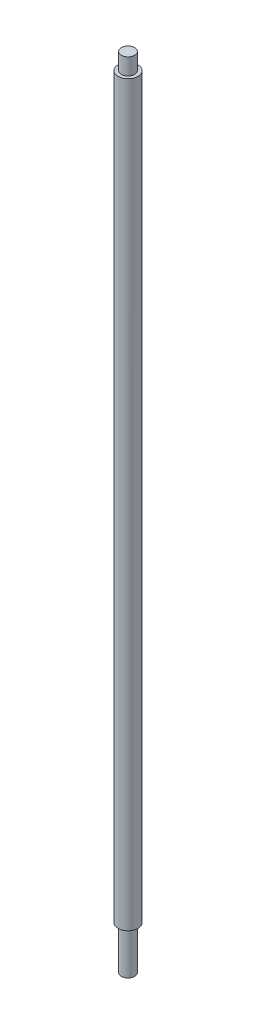
ISO-10303-21;
HEADER;
FILE_DESCRIPTION(('STEP AP214'),'2;1');
FILE_NAME('part.step','',(''),(''),'','','');
FILE_SCHEMA(('AUTOMOTIVE_DESIGN { 1 0 10303 214 1 1 1 1 }'));
ENDSEC;
DATA;
#1=APPLICATION_CONTEXT('core data for automotive mechanical design processes');
#2=APPLICATION_PROTOCOL_DEFINITION('international standard','automotive_design',2000,#1);
#3=PRODUCT_CONTEXT('',#1,'mechanical');
#4=PRODUCT('Part','Part','',(#3));
#5=PRODUCT_RELATED_PRODUCT_CATEGORY('part','',(#4));
#6=PRODUCT_DEFINITION_FORMATION('','',#4);
#7=PRODUCT_DEFINITION_CONTEXT('part definition',#1,'design');
#8=PRODUCT_DEFINITION('design','',#6,#7);
#9=PRODUCT_DEFINITION_SHAPE('','',#8);
#10=(LENGTH_UNIT() NAMED_UNIT(*) SI_UNIT(.MILLI.,.METRE.));
#11=(NAMED_UNIT(*) PLANE_ANGLE_UNIT() SI_UNIT($,.RADIAN.));
#12=(NAMED_UNIT(*) SI_UNIT($,.STERADIAN.) SOLID_ANGLE_UNIT());
#13=UNCERTAINTY_MEASURE_WITH_UNIT(LENGTH_MEASURE(1.E-05),#10,'distance_accuracy_value','');
#14=(GEOMETRIC_REPRESENTATION_CONTEXT(3) GLOBAL_UNCERTAINTY_ASSIGNED_CONTEXT((#13)) GLOBAL_UNIT_ASSIGNED_CONTEXT((#10,
#11,#12)) REPRESENTATION_CONTEXT('',''));
#15=CARTESIAN_POINT('',(0.,0.,0.));
#16=DIRECTION('',(0.,0.,1.));
#17=DIRECTION('',(1.,0.,0.));
#18=AXIS2_PLACEMENT_3D('',#15,#16,#17);
#19=CARTESIAN_POINT('',(0.,240.,0.));
#20=DIRECTION('',(0.,-1.,0.));
#21=DIRECTION('',(0.,0.,-1.));
#22=AXIS2_PLACEMENT_3D('',#19,#20,#21);
#23=CYLINDRICAL_SURFACE('',#22,6.);
#24=CARTESIAN_POINT('',(0.,230.,0.));
#25=DIRECTION('',(0.,1.,0.));
#26=DIRECTION('',(0.,0.,1.));
#27=AXIS2_PLACEMENT_3D('',#24,#25,#26);
#28=CIRCLE('',#27,6.);
#29=CARTESIAN_POINT('',(0.,230.,6.));
#30=VERTEX_POINT('',#29);
#31=EDGE_CURVE('E10',#30,#30,#28,.T.);
#32=ORIENTED_EDGE('',*,*,#31,.F.);
#33=EDGE_LOOP('',(#32));
#34=FACE_BOUND('',#33,.T.);
#35=CARTESIAN_POINT('',(0.,-214.000000122,0.));
#36=DIRECTION('',(0.,-1.,0.));
#37=DIRECTION('',(0.,0.,-1.));
#38=AXIS2_PLACEMENT_3D('',#35,#36,#37);
#39=CIRCLE('',#38,6.);
#40=CARTESIAN_POINT('',(0.,-214.000000122,-6.));
#41=VERTEX_POINT('',#40);
#42=EDGE_CURVE('E47',#41,#41,#39,.T.);
#43=ORIENTED_EDGE('',*,*,#42,.F.);
#44=EDGE_LOOP('',(#43));
#45=FACE_BOUND('',#44,.T.);
#46=ADVANCED_FACE('F32',(#34,#45),#23,.T.);
#47=CARTESIAN_POINT('',(0.,230.,0.));
#48=DIRECTION('',(0.,1.,0.));
#49=DIRECTION('',(0.,0.,1.));
#50=AXIS2_PLACEMENT_3D('',#47,#48,#49);
#51=PLANE('',#50);
#52=CARTESIAN_POINT('',(0.,230.,0.));
#53=DIRECTION('',(0.,1.,0.));
#54=DIRECTION('',(0.,0.,1.));
#55=AXIS2_PLACEMENT_3D('',#52,#53,#54);
#56=CIRCLE('',#55,4.);
#57=CARTESIAN_POINT('',(0.,230.,4.));
#58=VERTEX_POINT('',#57);
#59=EDGE_CURVE('E38',#58,#58,#56,.T.);
#60=ORIENTED_EDGE('',*,*,#59,.F.);
#61=EDGE_LOOP('',(#60));
#62=FACE_BOUND('',#61,.T.);
#63=ORIENTED_EDGE('',*,*,#31,.T.);
#64=EDGE_LOOP('',(#63));
#65=FACE_BOUND('',#64,.T.);
#66=ADVANCED_FACE('F69',(#62,#65),#51,.T.);
#67=CARTESIAN_POINT('',(0.,230.,0.));
#68=DIRECTION('',(0.,1.,0.));
#69=DIRECTION('',(0.,0.,1.));
#70=AXIS2_PLACEMENT_3D('',#67,#68,#69);
#71=CYLINDRICAL_SURFACE('',#70,4.);
#72=ORIENTED_EDGE('',*,*,#59,.T.);
#73=EDGE_LOOP('',(#72));
#74=FACE_BOUND('',#73,.T.);
#75=CARTESIAN_POINT('',(0.,240.,0.));
#76=DIRECTION('',(0.,1.,0.));
#77=DIRECTION('',(0.,0.,1.));
#78=AXIS2_PLACEMENT_3D('',#75,#76,#77);
#79=CIRCLE('',#78,4.);
#80=CARTESIAN_POINT('',(0.,240.,4.));
#81=VERTEX_POINT('',#80);
#82=EDGE_CURVE('E42',#81,#81,#79,.T.);
#83=ORIENTED_EDGE('',*,*,#82,.F.);
#84=EDGE_LOOP('',(#83));
#85=FACE_BOUND('',#84,.T.);
#86=ADVANCED_FACE('F74',(#74,#85),#71,.T.);
#87=CARTESIAN_POINT('',(0.,240.,0.));
#88=DIRECTION('',(0.,1.,0.));
#89=DIRECTION('',(0.,0.,1.));
#90=AXIS2_PLACEMENT_3D('',#87,#88,#89);
#91=PLANE('',#90);
#92=ORIENTED_EDGE('',*,*,#82,.T.);
#93=EDGE_LOOP('',(#92));
#94=FACE_BOUND('',#93,.T.);
#95=ADVANCED_FACE('F64',(#94),#91,.T.);
#96=CARTESIAN_POINT('',(0.,-214.000000122,0.));
#97=DIRECTION('',(0.,-1.,0.));
#98=DIRECTION('',(0.,0.,-1.));
#99=AXIS2_PLACEMENT_3D('',#96,#97,#98);
#100=PLANE('',#99);
#101=CARTESIAN_POINT('',(0.,-214.000000122,0.));
#102=DIRECTION('',(0.,-1.,0.));
#103=DIRECTION('',(0.,0.,-1.));
#104=AXIS2_PLACEMENT_3D('',#101,#102,#103);
#105=CIRCLE('',#104,4.);
#106=CARTESIAN_POINT('',(0.,-214.000000122,-4.));
#107=VERTEX_POINT('',#106);
#108=EDGE_CURVE('E51',#107,#107,#105,.T.);
#109=ORIENTED_EDGE('',*,*,#108,.F.);
#110=EDGE_LOOP('',(#109));
#111=FACE_BOUND('',#110,.T.);
#112=ORIENTED_EDGE('',*,*,#42,.T.);
#113=EDGE_LOOP('',(#112));
#114=FACE_BOUND('',#113,.T.);
#115=ADVANCED_FACE('F61',(#111,#114),#100,.T.);
#116=CARTESIAN_POINT('',(0.,-214.000000122,0.));
#117=DIRECTION('',(0.,-1.,0.));
#118=DIRECTION('',(0.,0.,-1.));
#119=AXIS2_PLACEMENT_3D('',#116,#117,#118);
#120=CYLINDRICAL_SURFACE('',#119,4.);
#121=ORIENTED_EDGE('',*,*,#108,.T.);
#122=EDGE_LOOP('',(#121));
#123=FACE_BOUND('',#122,.T.);
#124=CARTESIAN_POINT('',(0.,-240.,0.));
#125=DIRECTION('',(0.,-1.,0.));
#126=DIRECTION('',(0.,0.,-1.));
#127=AXIS2_PLACEMENT_3D('',#124,#125,#126);
#128=CIRCLE('',#127,4.);
#129=CARTESIAN_POINT('',(0.,-240.,-4.));
#130=VERTEX_POINT('',#129);
#131=EDGE_CURVE('E52',#130,#130,#128,.T.);
#132=ORIENTED_EDGE('',*,*,#131,.F.);
#133=EDGE_LOOP('',(#132));
#134=FACE_BOUND('',#133,.T.);
#135=ADVANCED_FACE('F58',(#123,#134),#120,.T.);
#136=CARTESIAN_POINT('',(0.,-240.,0.));
#137=DIRECTION('',(0.,1.,0.));
#138=DIRECTION('',(0.,0.,1.));
#139=AXIS2_PLACEMENT_3D('',#136,#137,#138);
#140=PLANE('',#139);
#141=ORIENTED_EDGE('',*,*,#131,.T.);
#142=EDGE_LOOP('',(#141));
#143=FACE_BOUND('',#142,.T.);
#144=ADVANCED_FACE('F84',(#143),#140,.F.);
#145=CLOSED_SHELL('',(#46,#66,#86,#95,#115,#135,#144));
#146=MANIFOLD_SOLID_BREP('B2',#145);
#147=ADVANCED_BREP_SHAPE_REPRESENTATION('',(#18,#146),#14);
#148=SHAPE_DEFINITION_REPRESENTATION(#9,#147);
ENDSEC;
END-ISO-10303-21;
